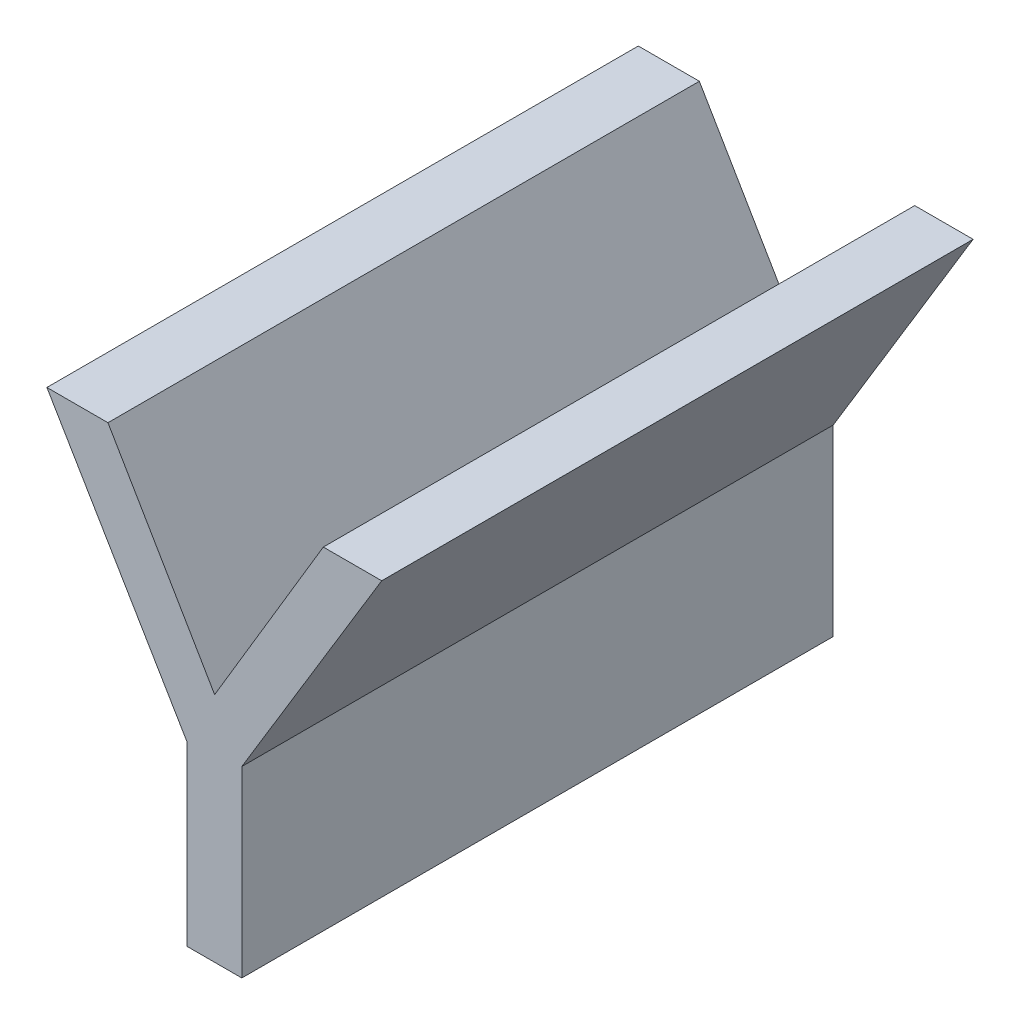
ISO-10303-21;
HEADER;
FILE_DESCRIPTION(('STEP AP214'),'2;1');
FILE_NAME('part.step','',(''),(''),'','','');
FILE_SCHEMA(('AUTOMOTIVE_DESIGN { 1 0 10303 214 1 1 1 1 }'));
ENDSEC;
DATA;
#1=APPLICATION_CONTEXT('core data for automotive mechanical design processes');
#2=APPLICATION_PROTOCOL_DEFINITION('international standard','automotive_design',2000,#1);
#3=PRODUCT_CONTEXT('',#1,'mechanical');
#4=PRODUCT('Part','Part','',(#3));
#5=PRODUCT_RELATED_PRODUCT_CATEGORY('part','',(#4));
#6=PRODUCT_DEFINITION_FORMATION('','',#4);
#7=PRODUCT_DEFINITION_CONTEXT('part definition',#1,'design');
#8=PRODUCT_DEFINITION('design','',#6,#7);
#9=PRODUCT_DEFINITION_SHAPE('','',#8);
#10=(LENGTH_UNIT() NAMED_UNIT(*) SI_UNIT(.MILLI.,.METRE.));
#11=(NAMED_UNIT(*) PLANE_ANGLE_UNIT() SI_UNIT($,.RADIAN.));
#12=(NAMED_UNIT(*) SI_UNIT($,.STERADIAN.) SOLID_ANGLE_UNIT());
#13=UNCERTAINTY_MEASURE_WITH_UNIT(LENGTH_MEASURE(1.E-05),#10,'distance_accuracy_value','');
#14=(GEOMETRIC_REPRESENTATION_CONTEXT(3) GLOBAL_UNCERTAINTY_ASSIGNED_CONTEXT((#13)) GLOBAL_UNIT_ASSIGNED_CONTEXT((#10,
#11,#12)) REPRESENTATION_CONTEXT('',''));
#15=CARTESIAN_POINT('',(0.,0.,0.));
#16=DIRECTION('',(0.,0.,1.));
#17=DIRECTION('',(1.,0.,0.));
#18=AXIS2_PLACEMENT_3D('',#15,#16,#17);
#19=CARTESIAN_POINT('',(0.189259021554462,-0.571914597659679,0.));
#20=DIRECTION('',(1.,0.,0.));
#21=DIRECTION('',(0.,1.,0.));
#22=AXIS2_PLACEMENT_3D('',#19,#20,#21);
#23=PLANE('',#22);
#24=DIRECTION('',(0.,-1.,0.));
#25=VECTOR('',#24,1.);
#26=CARTESIAN_POINT('',(0.189259021554462,-0.540942149377892,0.));
#27=LINE('',#26,#25);
#28=CARTESIAN_POINT('',(0.189259021554462,-0.540942149377892,0.));
#29=VERTEX_POINT('',#28);
#30=CARTESIAN_POINT('',(0.189259021554462,-0.571914597659679,0.));
#31=VERTEX_POINT('',#30);
#32=EDGE_CURVE('E11',#29,#31,#27,.T.);
#33=ORIENTED_EDGE('',*,*,#32,.F.);
#34=DIRECTION('',(0.,0.,1.));
#35=VECTOR('',#34,1.);
#36=CARTESIAN_POINT('',(0.189259021554462,-0.540942149377892,0.));
#37=LINE('',#36,#35);
#38=CARTESIAN_POINT('',(0.189259021554462,-0.540942149377892,0.1));
#39=VERTEX_POINT('',#38);
#40=EDGE_CURVE('E159',#29,#39,#37,.T.);
#41=ORIENTED_EDGE('',*,*,#40,.T.);
#42=DIRECTION('',(0.,1.,0.));
#43=VECTOR('',#42,1.);
#44=CARTESIAN_POINT('',(0.189259021554462,-0.571914597659679,0.1));
#45=LINE('',#44,#43);
#46=CARTESIAN_POINT('',(0.189259021554462,-0.571914597659679,0.1));
#47=VERTEX_POINT('',#46);
#48=EDGE_CURVE('E109',#47,#39,#45,.T.);
#49=ORIENTED_EDGE('',*,*,#48,.F.);
#50=DIRECTION('',(0.,0.,1.));
#51=VECTOR('',#50,1.);
#52=CARTESIAN_POINT('',(0.189259021554462,-0.571914597659679,0.));
#53=LINE('',#52,#51);
#54=EDGE_CURVE('E154',#31,#47,#53,.T.);
#55=ORIENTED_EDGE('',*,*,#54,.F.);
#56=EDGE_LOOP('',(#33,#41,#49,#55));
#57=FACE_BOUND('',#56,.T.);
#58=ADVANCED_FACE('F17',(#57),#23,.T.);
#59=CARTESIAN_POINT('',(0.179955941850775,-0.571914597659679,0.));
#60=DIRECTION('',(0.,-1.,0.));
#61=DIRECTION('',(1.,0.,0.));
#62=AXIS2_PLACEMENT_3D('',#59,#60,#61);
#63=PLANE('',#62);
#64=DIRECTION('',(-1.,0.,0.));
#65=VECTOR('',#64,1.);
#66=CARTESIAN_POINT('',(0.189259021554462,-0.571914597659679,0.));
#67=LINE('',#66,#65);
#68=CARTESIAN_POINT('',(0.179955941850775,-0.571914597659679,0.));
#69=VERTEX_POINT('',#68);
#70=EDGE_CURVE('E24',#31,#69,#67,.T.);
#71=ORIENTED_EDGE('',*,*,#70,.F.);
#72=ORIENTED_EDGE('',*,*,#54,.T.);
#73=DIRECTION('',(1.,0.,0.));
#74=VECTOR('',#73,1.);
#75=CARTESIAN_POINT('',(0.179955941850775,-0.571914597659679,0.1));
#76=LINE('',#75,#74);
#77=CARTESIAN_POINT('',(0.179955941850775,-0.571914597659679,0.1));
#78=VERTEX_POINT('',#77);
#79=EDGE_CURVE('E146',#78,#47,#76,.T.);
#80=ORIENTED_EDGE('',*,*,#79,.F.);
#81=DIRECTION('',(0.,0.,1.));
#82=VECTOR('',#81,1.);
#83=CARTESIAN_POINT('',(0.179955941850775,-0.571914597659679,0.));
#84=LINE('',#83,#82);
#85=EDGE_CURVE('E148',#69,#78,#84,.T.);
#86=ORIENTED_EDGE('',*,*,#85,.F.);
#87=EDGE_LOOP('',(#71,#72,#80,#86));
#88=FACE_BOUND('',#87,.T.);
#89=ADVANCED_FACE('F164',(#88),#63,.T.);
#90=CARTESIAN_POINT('',(0.179955941850775,-0.541906493005713,0.));
#91=DIRECTION('',(-1.,0.,0.));
#92=DIRECTION('',(0.,-1.,0.));
#93=AXIS2_PLACEMENT_3D('',#90,#91,#92);
#94=PLANE('',#93);
#95=DIRECTION('',(0.,1.,0.));
#96=VECTOR('',#95,1.);
#97=CARTESIAN_POINT('',(0.179955941850775,-0.571914597659679,0.));
#98=LINE('',#97,#96);
#99=CARTESIAN_POINT('',(0.179955941850775,-0.541906493005713,0.));
#100=VERTEX_POINT('',#99);
#101=EDGE_CURVE('E156',#69,#100,#98,.T.);
#102=ORIENTED_EDGE('',*,*,#101,.F.);
#103=ORIENTED_EDGE('',*,*,#85,.T.);
#104=DIRECTION('',(0.,-1.,0.));
#105=VECTOR('',#104,1.);
#106=CARTESIAN_POINT('',(0.179955941850775,-0.541906493005713,0.1));
#107=LINE('',#106,#105);
#108=CARTESIAN_POINT('',(0.179955941850775,-0.541906493005713,0.1));
#109=VERTEX_POINT('',#108);
#110=EDGE_CURVE('E138',#109,#78,#107,.T.);
#111=ORIENTED_EDGE('',*,*,#110,.F.);
#112=DIRECTION('',(0.,0.,1.));
#113=VECTOR('',#112,1.);
#114=CARTESIAN_POINT('',(0.179955941850775,-0.541906493005713,0.));
#115=LINE('',#114,#113);
#116=EDGE_CURVE('E141',#100,#109,#115,.T.);
#117=ORIENTED_EDGE('',*,*,#116,.F.);
#118=EDGE_LOOP('',(#102,#103,#111,#117));
#119=FACE_BOUND('',#118,.T.);
#120=ADVANCED_FACE('F166',(#119),#94,.T.);
#121=CARTESIAN_POINT('',(0.156301159921278,-0.50191459549901,0.));
#122=DIRECTION('',(-0.860707703064184,-0.509099449897539,0.));
#123=DIRECTION('',(0.509099449897539,-0.860707703064184,0.));
#124=AXIS2_PLACEMENT_3D('',#121,#122,#123);
#125=PLANE('',#124);
#126=DIRECTION('',(-0.509099449897539,0.860707703064184,0.));
#127=VECTOR('',#126,1.);
#128=CARTESIAN_POINT('',(0.179955941850775,-0.541906493005713,0.));
#129=LINE('',#128,#127);
#130=CARTESIAN_POINT('',(0.156301159921278,-0.50191459549901,0.));
#131=VERTEX_POINT('',#130);
#132=EDGE_CURVE('E150',#100,#131,#129,.T.);
#133=ORIENTED_EDGE('',*,*,#132,.F.);
#134=ORIENTED_EDGE('',*,*,#116,.T.);
#135=DIRECTION('',(0.50909944989754,-0.860707703064183,0.));
#136=VECTOR('',#135,1.);
#137=CARTESIAN_POINT('',(0.156301159921278,-0.50191459549901,0.1));
#138=LINE('',#137,#136);
#139=CARTESIAN_POINT('',(0.156301159921278,-0.50191459549901,0.1));
#140=VERTEX_POINT('',#139);
#141=EDGE_CURVE('E130',#140,#109,#138,.T.);
#142=ORIENTED_EDGE('',*,*,#141,.F.);
#143=DIRECTION('',(0.,0.,1.));
#144=VECTOR('',#143,1.);
#145=CARTESIAN_POINT('',(0.156301159921278,-0.50191459549901,0.));
#146=LINE('',#145,#144);
#147=EDGE_CURVE('E133',#131,#140,#146,.T.);
#148=ORIENTED_EDGE('',*,*,#147,.F.);
#149=EDGE_LOOP('',(#133,#134,#142,#148));
#150=FACE_BOUND('',#149,.T.);
#151=ADVANCED_FACE('F170',(#150),#125,.T.);
#152=CARTESIAN_POINT('',(0.166625309348541,-0.50191459549901,0.));
#153=DIRECTION('',(0.,1.,0.));
#154=DIRECTION('',(-1.,0.,0.));
#155=AXIS2_PLACEMENT_3D('',#152,#153,#154);
#156=PLANE('',#155);
#157=DIRECTION('',(1.,0.,0.));
#158=VECTOR('',#157,1.);
#159=CARTESIAN_POINT('',(0.156301159921278,-0.50191459549901,0.));
#160=LINE('',#159,#158);
#161=CARTESIAN_POINT('',(0.166625309348541,-0.50191459549901,0.));
#162=VERTEX_POINT('',#161);
#163=EDGE_CURVE('E143',#131,#162,#160,.T.);
#164=ORIENTED_EDGE('',*,*,#163,.F.);
#165=ORIENTED_EDGE('',*,*,#147,.T.);
#166=DIRECTION('',(-1.,0.,0.));
#167=VECTOR('',#166,1.);
#168=CARTESIAN_POINT('',(0.166625309348541,-0.50191459549901,0.1));
#169=LINE('',#168,#167);
#170=CARTESIAN_POINT('',(0.166625309348541,-0.50191459549901,0.1));
#171=VERTEX_POINT('',#170);
#172=EDGE_CURVE('E122',#171,#140,#169,.T.);
#173=ORIENTED_EDGE('',*,*,#172,.F.);
#174=DIRECTION('',(0.,0.,1.));
#175=VECTOR('',#174,1.);
#176=CARTESIAN_POINT('',(0.166625309348541,-0.50191459549901,0.));
#177=LINE('',#176,#175);
#178=EDGE_CURVE('E125',#162,#171,#177,.T.);
#179=ORIENTED_EDGE('',*,*,#178,.F.);
#180=EDGE_LOOP('',(#164,#165,#173,#179));
#181=FACE_BOUND('',#180,.T.);
#182=ADVANCED_FACE('F174',(#181),#156,.T.);
#183=CARTESIAN_POINT('',(0.184664207798373,-0.532716865493534,0.));
#184=DIRECTION('',(0.862913061259437,0.505352400516577,0.));
#185=DIRECTION('',(-0.505352400516577,0.862913061259437,0.));
#186=AXIS2_PLACEMENT_3D('',#183,#184,#185);
#187=PLANE('',#186);
#188=DIRECTION('',(0.505352400516577,-0.862913061259437,0.));
#189=VECTOR('',#188,1.);
#190=CARTESIAN_POINT('',(0.166625309348541,-0.50191459549901,0.));
#191=LINE('',#190,#189);
#192=CARTESIAN_POINT('',(0.184664207798373,-0.532716865493534,0.));
#193=VERTEX_POINT('',#192);
#194=EDGE_CURVE('E135',#162,#193,#191,.T.);
#195=ORIENTED_EDGE('',*,*,#194,.F.);
#196=ORIENTED_EDGE('',*,*,#178,.T.);
#197=DIRECTION('',(-0.505352400516576,0.862913061259437,0.));
#198=VECTOR('',#197,1.);
#199=CARTESIAN_POINT('',(0.184664207798373,-0.532716865493534,0.1));
#200=LINE('',#199,#198);
#201=CARTESIAN_POINT('',(0.184664207798373,-0.532716865493534,0.1));
#202=VERTEX_POINT('',#201);
#203=EDGE_CURVE('E115',#202,#171,#200,.T.);
#204=ORIENTED_EDGE('',*,*,#203,.F.);
#205=DIRECTION('',(0.,0.,1.));
#206=VECTOR('',#205,1.);
#207=CARTESIAN_POINT('',(0.184664207798373,-0.532716865493534,0.));
#208=LINE('',#207,#206);
#209=EDGE_CURVE('E118',#193,#202,#208,.T.);
#210=ORIENTED_EDGE('',*,*,#209,.F.);
#211=EDGE_LOOP('',(#195,#196,#204,#210));
#212=FACE_BOUND('',#211,.T.);
#213=ADVANCED_FACE('F178',(#212),#187,.T.);
#214=CARTESIAN_POINT('',(0.20304346282273,-0.50191459549901,0.));
#215=DIRECTION('',(-0.858746256029892,0.512401080946014,0.));
#216=DIRECTION('',(-0.512401080946014,-0.858746256029892,0.));
#217=AXIS2_PLACEMENT_3D('',#214,#215,#216);
#218=PLANE('',#217);
#219=DIRECTION('',(0.512401080946013,0.858746256029893,0.));
#220=VECTOR('',#219,1.);
#221=CARTESIAN_POINT('',(0.184664207798373,-0.532716865493534,0.));
#222=LINE('',#221,#220);
#223=CARTESIAN_POINT('',(0.20304346282273,-0.50191459549901,0.));
#224=VERTEX_POINT('',#223);
#225=EDGE_CURVE('E127',#193,#224,#222,.T.);
#226=ORIENTED_EDGE('',*,*,#225,.F.);
#227=ORIENTED_EDGE('',*,*,#209,.T.);
#228=DIRECTION('',(-0.512401080946013,-0.858746256029892,0.));
#229=VECTOR('',#228,1.);
#230=CARTESIAN_POINT('',(0.20304346282273,-0.50191459549901,0.1));
#231=LINE('',#230,#229);
#232=CARTESIAN_POINT('',(0.20304346282273,-0.50191459549901,0.1));
#233=VERTEX_POINT('',#232);
#234=EDGE_CURVE('E95',#233,#202,#231,.T.);
#235=ORIENTED_EDGE('',*,*,#234,.F.);
#236=DIRECTION('',(0.,0.,1.));
#237=VECTOR('',#236,1.);
#238=CARTESIAN_POINT('',(0.20304346282273,-0.50191459549901,0.));
#239=LINE('',#238,#237);
#240=EDGE_CURVE('E101',#224,#233,#239,.T.);
#241=ORIENTED_EDGE('',*,*,#240,.F.);
#242=EDGE_LOOP('',(#226,#227,#235,#241));
#243=FACE_BOUND('',#242,.T.);
#244=ADVANCED_FACE('F181',(#243),#218,.T.);
#245=CARTESIAN_POINT('',(0.212913803483958,-0.50191459549901,0.));
#246=DIRECTION('',(0.,1.,0.));
#247=DIRECTION('',(-1.,0.,0.));
#248=AXIS2_PLACEMENT_3D('',#245,#246,#247);
#249=PLANE('',#248);
#250=DIRECTION('',(1.,0.,0.));
#251=VECTOR('',#250,1.);
#252=CARTESIAN_POINT('',(0.20304346282273,-0.50191459549901,0.));
#253=LINE('',#252,#251);
#254=CARTESIAN_POINT('',(0.212913803483958,-0.50191459549901,0.));
#255=VERTEX_POINT('',#254);
#256=EDGE_CURVE('E120',#224,#255,#253,.T.);
#257=ORIENTED_EDGE('',*,*,#256,.F.);
#258=ORIENTED_EDGE('',*,*,#240,.T.);
#259=DIRECTION('',(-1.,0.,0.));
#260=VECTOR('',#259,1.);
#261=CARTESIAN_POINT('',(0.212913803483958,-0.50191459549901,0.1));
#262=LINE('',#261,#260);
#263=CARTESIAN_POINT('',(0.212913803483958,-0.50191459549901,0.1));
#264=VERTEX_POINT('',#263);
#265=EDGE_CURVE('E96',#264,#233,#262,.T.);
#266=ORIENTED_EDGE('',*,*,#265,.F.);
#267=DIRECTION('',(0.,0.,1.));
#268=VECTOR('',#267,1.);
#269=CARTESIAN_POINT('',(0.212913803483958,-0.50191459549901,0.));
#270=LINE('',#269,#268);
#271=EDGE_CURVE('E85',#255,#264,#270,.T.);
#272=ORIENTED_EDGE('',*,*,#271,.F.);
#273=EDGE_LOOP('',(#257,#258,#266,#272));
#274=FACE_BOUND('',#273,.T.);
#275=ADVANCED_FACE('F99',(#274),#249,.T.);
#276=CARTESIAN_POINT('',(0.189259021554462,-0.540942149377892,0.));
#277=DIRECTION('',(0.855181135397279,-0.518329263750968,0.));
#278=DIRECTION('',(0.518329263750968,0.855181135397279,0.));
#279=AXIS2_PLACEMENT_3D('',#276,#277,#278);
#280=PLANE('',#279);
#281=DIRECTION('',(-0.518329263750968,-0.855181135397279,0.));
#282=VECTOR('',#281,1.);
#283=CARTESIAN_POINT('',(0.212913803483958,-0.50191459549901,0.));
#284=LINE('',#283,#282);
#285=EDGE_CURVE('E92',#255,#29,#284,.T.);
#286=ORIENTED_EDGE('',*,*,#285,.F.);
#287=ORIENTED_EDGE('',*,*,#271,.T.);
#288=DIRECTION('',(0.518329263750968,0.855181135397279,0.));
#289=VECTOR('',#288,1.);
#290=CARTESIAN_POINT('',(0.189259021554461,-0.540942149377892,0.1));
#291=LINE('',#290,#289);
#292=EDGE_CURVE('E90',#39,#264,#291,.T.);
#293=ORIENTED_EDGE('',*,*,#292,.F.);
#294=ORIENTED_EDGE('',*,*,#40,.F.);
#295=EDGE_LOOP('',(#286,#287,#293,#294));
#296=FACE_BOUND('',#295,.T.);
#297=ADVANCED_FACE('F87',(#296),#280,.T.);
#298=CARTESIAN_POINT('',(0.184585107814773,-0.529110965789332,0.));
#299=DIRECTION('',(0.,0.,1.));
#300=DIRECTION('',(1.,0.,0.));
#301=AXIS2_PLACEMENT_3D('',#298,#299,#300);
#302=PLANE('',#301);
#303=ORIENTED_EDGE('',*,*,#285,.T.);
#304=ORIENTED_EDGE('',*,*,#32,.T.);
#305=ORIENTED_EDGE('',*,*,#70,.T.);
#306=ORIENTED_EDGE('',*,*,#101,.T.);
#307=ORIENTED_EDGE('',*,*,#132,.T.);
#308=ORIENTED_EDGE('',*,*,#163,.T.);
#309=ORIENTED_EDGE('',*,*,#194,.T.);
#310=ORIENTED_EDGE('',*,*,#225,.T.);
#311=ORIENTED_EDGE('',*,*,#256,.T.);
#312=EDGE_LOOP('',(#303,#304,#305,#306,#307,#308,#309,#310,#311));
#313=FACE_BOUND('',#312,.T.);
#314=ADVANCED_FACE('F161',(#313),#302,.F.);
#315=CARTESIAN_POINT('',(0.184585107814773,-0.529110965789332,0.1));
#316=DIRECTION('',(0.,0.,1.));
#317=DIRECTION('',(1.,0.,0.));
#318=AXIS2_PLACEMENT_3D('',#315,#316,#317);
#319=PLANE('',#318);
#320=ORIENTED_EDGE('',*,*,#292,.T.);
#321=ORIENTED_EDGE('',*,*,#265,.T.);
#322=ORIENTED_EDGE('',*,*,#234,.T.);
#323=ORIENTED_EDGE('',*,*,#203,.T.);
#324=ORIENTED_EDGE('',*,*,#172,.T.);
#325=ORIENTED_EDGE('',*,*,#141,.T.);
#326=ORIENTED_EDGE('',*,*,#110,.T.);
#327=ORIENTED_EDGE('',*,*,#79,.T.);
#328=ORIENTED_EDGE('',*,*,#48,.T.);
#329=EDGE_LOOP('',(#320,#321,#322,#323,#324,#325,#326,#327,#328));
#330=FACE_BOUND('',#329,.T.);
#331=ADVANCED_FACE('F106',(#330),#319,.T.);
#332=CLOSED_SHELL('',(#58,#89,#120,#151,#182,#213,#244,#275,#297,#314,#331));
#333=MANIFOLD_SOLID_BREP('B1',#332);
#334=ADVANCED_BREP_SHAPE_REPRESENTATION('',(#18,#333),#14);
#335=SHAPE_DEFINITION_REPRESENTATION(#9,#334);
ENDSEC;
END-ISO-10303-21;
